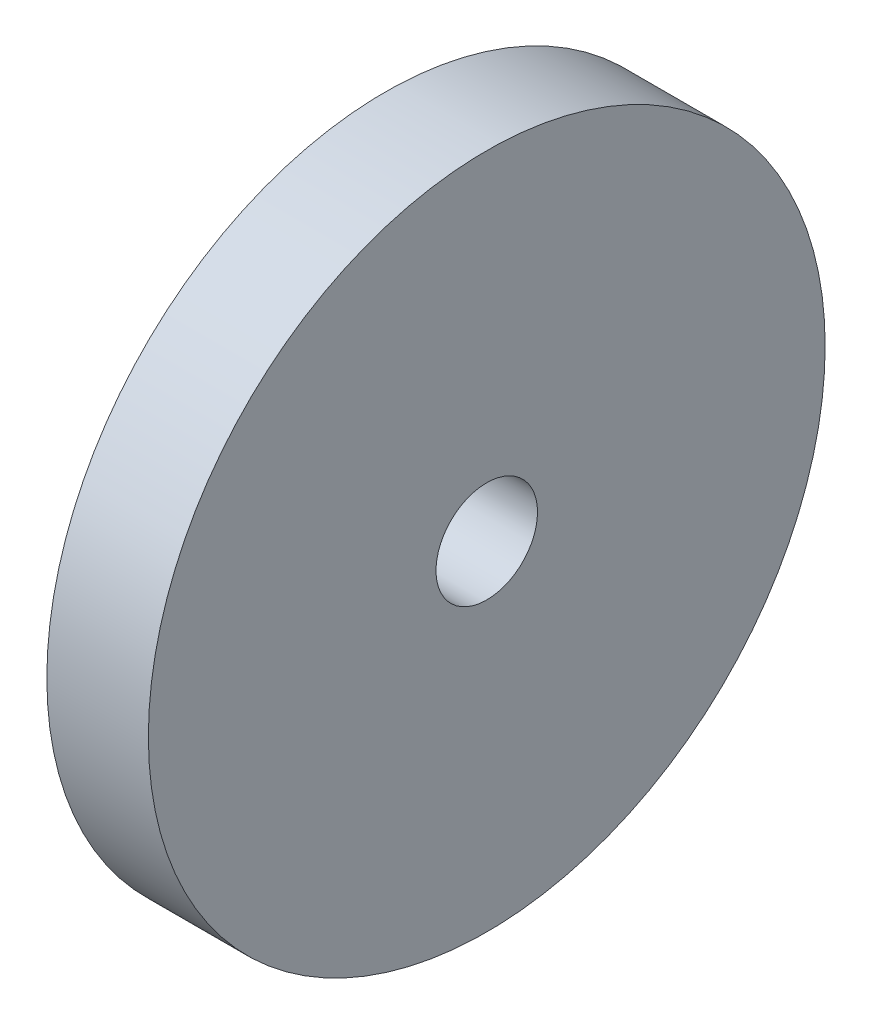
ISO-10303-21;
HEADER;
FILE_DESCRIPTION(('STEP AP214'),'2;1');
FILE_NAME('part.step','',(''),(''),'','','');
FILE_SCHEMA(('AUTOMOTIVE_DESIGN { 1 0 10303 214 1 1 1 1 }'));
ENDSEC;
DATA;
#1=APPLICATION_CONTEXT('core data for automotive mechanical design processes');
#2=APPLICATION_PROTOCOL_DEFINITION('international standard','automotive_design',2000,#1);
#3=PRODUCT_CONTEXT('',#1,'mechanical');
#4=PRODUCT('Part','Part','',(#3));
#5=PRODUCT_RELATED_PRODUCT_CATEGORY('part','',(#4));
#6=PRODUCT_DEFINITION_FORMATION('','',#4);
#7=PRODUCT_DEFINITION_CONTEXT('part definition',#1,'design');
#8=PRODUCT_DEFINITION('design','',#6,#7);
#9=PRODUCT_DEFINITION_SHAPE('','',#8);
#10=(LENGTH_UNIT() NAMED_UNIT(*) SI_UNIT(.MILLI.,.METRE.));
#11=(NAMED_UNIT(*) PLANE_ANGLE_UNIT() SI_UNIT($,.RADIAN.));
#12=(NAMED_UNIT(*) SI_UNIT($,.STERADIAN.) SOLID_ANGLE_UNIT());
#13=UNCERTAINTY_MEASURE_WITH_UNIT(LENGTH_MEASURE(1.E-05),#10,'distance_accuracy_value','');
#14=(GEOMETRIC_REPRESENTATION_CONTEXT(3) GLOBAL_UNCERTAINTY_ASSIGNED_CONTEXT((#13)) GLOBAL_UNIT_ASSIGNED_CONTEXT((#10,
#11,#12)) REPRESENTATION_CONTEXT('',''));
#15=CARTESIAN_POINT('',(0.,0.,0.));
#16=DIRECTION('',(0.,0.,1.));
#17=DIRECTION('',(1.,0.,0.));
#18=AXIS2_PLACEMENT_3D('',#15,#16,#17);
#19=CARTESIAN_POINT('',(3.,0.,0.));
#20=DIRECTION('',(-1.,0.,0.));
#21=DIRECTION('',(0.,0.,1.));
#22=AXIS2_PLACEMENT_3D('',#19,#20,#21);
#23=CYLINDRICAL_SURFACE('',#22,10.);
#24=CARTESIAN_POINT('',(3.,0.,0.));
#25=DIRECTION('',(1.,0.,0.));
#26=DIRECTION('',(0.,0.,-1.));
#27=AXIS2_PLACEMENT_3D('',#24,#25,#26);
#28=CIRCLE('',#27,10.);
#29=CARTESIAN_POINT('',(3.,0.,-10.));
#30=VERTEX_POINT('',#29);
#31=EDGE_CURVE('E10',#30,#30,#28,.T.);
#32=ORIENTED_EDGE('',*,*,#31,.F.);
#33=EDGE_LOOP('',(#32));
#34=FACE_BOUND('',#33,.T.);
#35=CARTESIAN_POINT('',(0.,0.,0.));
#36=DIRECTION('',(1.,0.,0.));
#37=DIRECTION('',(0.,0.,-1.));
#38=AXIS2_PLACEMENT_3D('',#35,#36,#37);
#39=CIRCLE('',#38,10.);
#40=CARTESIAN_POINT('',(0.,0.,-10.));
#41=VERTEX_POINT('',#40);
#42=EDGE_CURVE('E35',#41,#41,#39,.T.);
#43=ORIENTED_EDGE('',*,*,#42,.T.);
#44=EDGE_LOOP('',(#43));
#45=FACE_BOUND('',#44,.T.);
#46=ADVANCED_FACE('F32',(#34,#45),#23,.T.);
#47=CARTESIAN_POINT('',(3.,0.,0.));
#48=DIRECTION('',(1.,0.,0.));
#49=DIRECTION('',(0.,0.,-1.));
#50=AXIS2_PLACEMENT_3D('',#47,#48,#49);
#51=PLANE('',#50);
#52=CARTESIAN_POINT('',(3.,0.,0.));
#53=DIRECTION('',(1.,0.,0.));
#54=DIRECTION('',(0.,0.,-1.));
#55=AXIS2_PLACEMENT_3D('',#52,#53,#54);
#56=CIRCLE('',#55,1.5);
#57=CARTESIAN_POINT('',(3.,0.,-1.5));
#58=VERTEX_POINT('',#57);
#59=EDGE_CURVE('E44',#58,#58,#56,.T.);
#60=ORIENTED_EDGE('',*,*,#59,.F.);
#61=EDGE_LOOP('',(#60));
#62=FACE_BOUND('',#61,.T.);
#63=ORIENTED_EDGE('',*,*,#31,.T.);
#64=EDGE_LOOP('',(#63));
#65=FACE_BOUND('',#64,.T.);
#66=ADVANCED_FACE('F59',(#62,#65),#51,.T.);
#67=CARTESIAN_POINT('',(0.,0.,0.));
#68=DIRECTION('',(1.,0.,0.));
#69=DIRECTION('',(0.,0.,-1.));
#70=AXIS2_PLACEMENT_3D('',#67,#68,#69);
#71=PLANE('',#70);
#72=CARTESIAN_POINT('',(0.,0.,0.));
#73=DIRECTION('',(1.,0.,0.));
#74=DIRECTION('',(0.,0.,-1.));
#75=AXIS2_PLACEMENT_3D('',#72,#73,#74);
#76=CIRCLE('',#75,1.5);
#77=CARTESIAN_POINT('',(0.,0.,-1.5));
#78=VERTEX_POINT('',#77);
#79=EDGE_CURVE('E42',#78,#78,#76,.T.);
#80=ORIENTED_EDGE('',*,*,#79,.T.);
#81=EDGE_LOOP('',(#80));
#82=FACE_BOUND('',#81,.T.);
#83=ORIENTED_EDGE('',*,*,#42,.F.);
#84=EDGE_LOOP('',(#83));
#85=FACE_BOUND('',#84,.T.);
#86=ADVANCED_FACE('F50',(#82,#85),#71,.F.);
#87=CARTESIAN_POINT('',(0.,0.,0.));
#88=DIRECTION('',(1.,0.,0.));
#89=DIRECTION('',(0.,0.,-1.));
#90=AXIS2_PLACEMENT_3D('',#87,#88,#89);
#91=CYLINDRICAL_SURFACE('',#90,1.5);
#92=ORIENTED_EDGE('',*,*,#79,.F.);
#93=EDGE_LOOP('',(#92));
#94=FACE_BOUND('',#93,.T.);
#95=ORIENTED_EDGE('',*,*,#59,.T.);
#96=EDGE_LOOP('',(#95));
#97=FACE_BOUND('',#96,.T.);
#98=ADVANCED_FACE('F53',(#94,#97),#91,.F.);
#99=CLOSED_SHELL('',(#46,#66,#86,#98));
#100=MANIFOLD_SOLID_BREP('B2',#99);
#101=ADVANCED_BREP_SHAPE_REPRESENTATION('',(#18,#100),#14);
#102=SHAPE_DEFINITION_REPRESENTATION(#9,#101);
ENDSEC;
END-ISO-10303-21;
